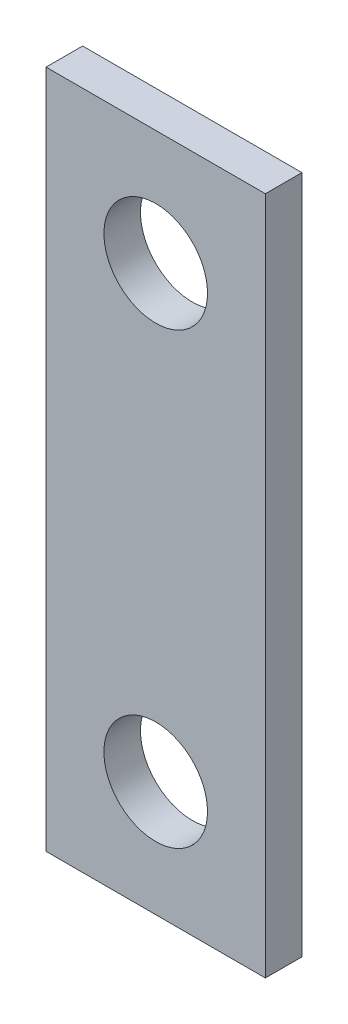
ISO-10303-21;
HEADER;
FILE_DESCRIPTION(('STEP AP214'),'2;1');
FILE_NAME('part.step','',(''),(''),'','','');
FILE_SCHEMA(('AUTOMOTIVE_DESIGN { 1 0 10303 214 1 1 1 1 }'));
ENDSEC;
DATA;
#1=APPLICATION_CONTEXT('core data for automotive mechanical design processes');
#2=APPLICATION_PROTOCOL_DEFINITION('international standard','automotive_design',2000,#1);
#3=PRODUCT_CONTEXT('',#1,'mechanical');
#4=PRODUCT('Part','Part','',(#3));
#5=PRODUCT_RELATED_PRODUCT_CATEGORY('part','',(#4));
#6=PRODUCT_DEFINITION_FORMATION('','',#4);
#7=PRODUCT_DEFINITION_CONTEXT('part definition',#1,'design');
#8=PRODUCT_DEFINITION('design','',#6,#7);
#9=PRODUCT_DEFINITION_SHAPE('','',#8);
#10=(LENGTH_UNIT() NAMED_UNIT(*) SI_UNIT(.MILLI.,.METRE.));
#11=(NAMED_UNIT(*) PLANE_ANGLE_UNIT() SI_UNIT($,.RADIAN.));
#12=(NAMED_UNIT(*) SI_UNIT($,.STERADIAN.) SOLID_ANGLE_UNIT());
#13=UNCERTAINTY_MEASURE_WITH_UNIT(LENGTH_MEASURE(1.E-05),#10,'distance_accuracy_value','');
#14=(GEOMETRIC_REPRESENTATION_CONTEXT(3) GLOBAL_UNCERTAINTY_ASSIGNED_CONTEXT((#13)) GLOBAL_UNIT_ASSIGNED_CONTEXT((#10,
#11,#12)) REPRESENTATION_CONTEXT('',''));
#15=CARTESIAN_POINT('',(0.,0.,0.));
#16=DIRECTION('',(0.,0.,1.));
#17=DIRECTION('',(1.,0.,0.));
#18=AXIS2_PLACEMENT_3D('',#15,#16,#17);
#19=CARTESIAN_POINT('',(7.47499999999997,9.99999999999999,3.175));
#20=DIRECTION('',(0.,1.,0.));
#21=DIRECTION('',(0.,0.,1.));
#22=AXIS2_PLACEMENT_3D('',#19,#20,#21);
#23=PLANE('',#22);
#24=DIRECTION('',(1.,0.,0.));
#25=VECTOR('',#24,1.);
#26=CARTESIAN_POINT('',(7.47499999999997,9.99999999999999,0.));
#27=LINE('',#26,#25);
#28=CARTESIAN_POINT('',(7.47499999999997,9.99999999999999,0.));
#29=VERTEX_POINT('',#28);
#30=CARTESIAN_POINT('',(26.525,9.99999999999999,0.));
#31=VERTEX_POINT('',#30);
#32=EDGE_CURVE('E99',#29,#31,#27,.T.);
#33=ORIENTED_EDGE('',*,*,#32,.F.);
#34=DIRECTION('',(0.,0.,-1.));
#35=VECTOR('',#34,1.);
#36=CARTESIAN_POINT('',(7.47499999999997,9.99999999999999,3.175));
#37=LINE('',#36,#35);
#38=CARTESIAN_POINT('',(7.47499999999997,9.99999999999999,3.175));
#39=VERTEX_POINT('',#38);
#40=EDGE_CURVE('E11',#39,#29,#37,.T.);
#41=ORIENTED_EDGE('',*,*,#40,.F.);
#42=DIRECTION('',(1.,0.,0.));
#43=VECTOR('',#42,1.);
#44=CARTESIAN_POINT('',(7.47499999999997,9.99999999999999,3.175));
#45=LINE('',#44,#43);
#46=CARTESIAN_POINT('',(26.525,9.99999999999999,3.175));
#47=VERTEX_POINT('',#46);
#48=EDGE_CURVE('E93',#39,#47,#45,.T.);
#49=ORIENTED_EDGE('',*,*,#48,.T.);
#50=DIRECTION('',(0.,0.,-1.));
#51=VECTOR('',#50,1.);
#52=CARTESIAN_POINT('',(26.525,9.99999999999999,3.175));
#53=LINE('',#52,#51);
#54=EDGE_CURVE('E36',#47,#31,#53,.T.);
#55=ORIENTED_EDGE('',*,*,#54,.T.);
#56=EDGE_LOOP('',(#33,#41,#49,#55));
#57=FACE_BOUND('',#56,.T.);
#58=ADVANCED_FACE('F33',(#57),#23,.T.);
#59=CARTESIAN_POINT('',(7.47499999999997,9.99999999999999,3.175));
#60=DIRECTION('',(1.,0.,0.));
#61=DIRECTION('',(0.,1.,0.));
#62=AXIS2_PLACEMENT_3D('',#59,#60,#61);
#63=PLANE('',#62);
#64=DIRECTION('',(0.,-1.,0.));
#65=VECTOR('',#64,1.);
#66=CARTESIAN_POINT('',(7.47499999999997,9.99999999999999,0.));
#67=LINE('',#66,#65);
#68=CARTESIAN_POINT('',(7.47499999999997,-49.0000000000002,0.));
#69=VERTEX_POINT('',#68);
#70=EDGE_CURVE('E66',#29,#69,#67,.T.);
#71=ORIENTED_EDGE('',*,*,#70,.T.);
#72=DIRECTION('',(0.,0.,-1.));
#73=VECTOR('',#72,1.);
#74=CARTESIAN_POINT('',(7.47499999999997,-49.0000000000002,3.175));
#75=LINE('',#74,#73);
#76=CARTESIAN_POINT('',(7.47499999999997,-49.0000000000002,3.175));
#77=VERTEX_POINT('',#76);
#78=EDGE_CURVE('E42',#77,#69,#75,.T.);
#79=ORIENTED_EDGE('',*,*,#78,.F.);
#80=DIRECTION('',(0.,-1.,0.));
#81=VECTOR('',#80,1.);
#82=CARTESIAN_POINT('',(7.47499999999997,9.99999999999999,3.175));
#83=LINE('',#82,#81);
#84=EDGE_CURVE('E83',#39,#77,#83,.T.);
#85=ORIENTED_EDGE('',*,*,#84,.F.);
#86=ORIENTED_EDGE('',*,*,#40,.T.);
#87=EDGE_LOOP('',(#71,#79,#85,#86));
#88=FACE_BOUND('',#87,.T.);
#89=ADVANCED_FACE('F110',(#88),#63,.F.);
#90=CARTESIAN_POINT('',(7.47499999999997,-49.0000000000002,3.175));
#91=DIRECTION('',(0.,1.,0.));
#92=DIRECTION('',(0.,0.,1.));
#93=AXIS2_PLACEMENT_3D('',#90,#91,#92);
#94=PLANE('',#93);
#95=DIRECTION('',(1.,0.,0.));
#96=VECTOR('',#95,1.);
#97=CARTESIAN_POINT('',(7.47499999999997,-49.0000000000002,0.));
#98=LINE('',#97,#96);
#99=CARTESIAN_POINT('',(26.525,-49.0000000000002,0.));
#100=VERTEX_POINT('',#99);
#101=EDGE_CURVE('E90',#69,#100,#98,.T.);
#102=ORIENTED_EDGE('',*,*,#101,.T.);
#103=DIRECTION('',(0.,0.,-1.));
#104=VECTOR('',#103,1.);
#105=CARTESIAN_POINT('',(26.525,-49.0000000000002,3.175));
#106=LINE('',#105,#104);
#107=CARTESIAN_POINT('',(26.525,-49.0000000000002,3.175));
#108=VERTEX_POINT('',#107);
#109=EDGE_CURVE('E87',#108,#100,#106,.T.);
#110=ORIENTED_EDGE('',*,*,#109,.F.);
#111=DIRECTION('',(1.,0.,0.));
#112=VECTOR('',#111,1.);
#113=CARTESIAN_POINT('',(7.47499999999997,-49.0000000000002,3.175));
#114=LINE('',#113,#112);
#115=EDGE_CURVE('E78',#77,#108,#114,.T.);
#116=ORIENTED_EDGE('',*,*,#115,.F.);
#117=ORIENTED_EDGE('',*,*,#78,.T.);
#118=EDGE_LOOP('',(#102,#110,#116,#117));
#119=FACE_BOUND('',#118,.T.);
#120=ADVANCED_FACE('F88',(#119),#94,.F.);
#121=CARTESIAN_POINT('',(26.525,9.99999999999999,3.175));
#122=DIRECTION('',(1.,0.,0.));
#123=DIRECTION('',(0.,1.,0.));
#124=AXIS2_PLACEMENT_3D('',#121,#122,#123);
#125=PLANE('',#124);
#126=DIRECTION('',(0.,-1.,0.));
#127=VECTOR('',#126,1.);
#128=CARTESIAN_POINT('',(26.525,9.99999999999999,0.));
#129=LINE('',#128,#127);
#130=EDGE_CURVE('E102',#31,#100,#129,.T.);
#131=ORIENTED_EDGE('',*,*,#130,.F.);
#132=ORIENTED_EDGE('',*,*,#54,.F.);
#133=DIRECTION('',(0.,-1.,0.));
#134=VECTOR('',#133,1.);
#135=CARTESIAN_POINT('',(26.525,9.99999999999999,3.175));
#136=LINE('',#135,#134);
#137=EDGE_CURVE('E82',#47,#108,#136,.T.);
#138=ORIENTED_EDGE('',*,*,#137,.T.);
#139=ORIENTED_EDGE('',*,*,#109,.T.);
#140=EDGE_LOOP('',(#131,#132,#138,#139));
#141=FACE_BOUND('',#140,.T.);
#142=ADVANCED_FACE('F92',(#141),#125,.T.);
#143=CARTESIAN_POINT('',(0.,0.,3.175));
#144=DIRECTION('',(0.,0.,-1.));
#145=DIRECTION('',(-1.,0.,0.));
#146=AXIS2_PLACEMENT_3D('',#143,#144,#145);
#147=PLANE('',#146);
#148=CARTESIAN_POINT('',(17.,0.,3.175));
#149=DIRECTION('',(0.,0.,1.));
#150=DIRECTION('',(1.,0.,0.));
#151=AXIS2_PLACEMENT_3D('',#148,#149,#150);
#152=CIRCLE('',#151,4.5);
#153=CARTESIAN_POINT('',(21.5,0.,3.175));
#154=VERTEX_POINT('',#153);
#155=EDGE_CURVE('E147',#154,#154,#152,.T.);
#156=ORIENTED_EDGE('',*,*,#155,.F.);
#157=EDGE_LOOP('',(#156));
#158=FACE_BOUND('',#157,.T.);
#159=CARTESIAN_POINT('',(17.,-39.0000000000001,3.175));
#160=DIRECTION('',(0.,0.,1.));
#161=DIRECTION('',(1.,0.,0.));
#162=AXIS2_PLACEMENT_3D('',#159,#160,#161);
#163=CIRCLE('',#162,4.5);
#164=CARTESIAN_POINT('',(21.5,-39.0000000000001,3.175));
#165=VERTEX_POINT('',#164);
#166=EDGE_CURVE('E149',#165,#165,#163,.T.);
#167=ORIENTED_EDGE('',*,*,#166,.F.);
#168=EDGE_LOOP('',(#167));
#169=FACE_BOUND('',#168,.T.);
#170=ORIENTED_EDGE('',*,*,#48,.F.);
#171=ORIENTED_EDGE('',*,*,#84,.T.);
#172=ORIENTED_EDGE('',*,*,#115,.T.);
#173=ORIENTED_EDGE('',*,*,#137,.F.);
#174=EDGE_LOOP('',(#170,#171,#172,#173));
#175=FACE_BOUND('',#174,.T.);
#176=ADVANCED_FACE('F81',(#158,#169,#175),#147,.F.);
#177=CARTESIAN_POINT('',(0.,0.,0.));
#178=DIRECTION('',(0.,0.,-1.));
#179=DIRECTION('',(-1.,0.,0.));
#180=AXIS2_PLACEMENT_3D('',#177,#178,#179);
#181=PLANE('',#180);
#182=CARTESIAN_POINT('',(17.,0.,0.));
#183=DIRECTION('',(0.,0.,1.));
#184=DIRECTION('',(1.,0.,0.));
#185=AXIS2_PLACEMENT_3D('',#182,#183,#184);
#186=CIRCLE('',#185,4.5);
#187=CARTESIAN_POINT('',(21.5,0.,0.));
#188=VERTEX_POINT('',#187);
#189=EDGE_CURVE('E145',#188,#188,#186,.T.);
#190=ORIENTED_EDGE('',*,*,#189,.T.);
#191=EDGE_LOOP('',(#190));
#192=FACE_BOUND('',#191,.T.);
#193=CARTESIAN_POINT('',(17.,-39.0000000000001,0.));
#194=DIRECTION('',(0.,0.,1.));
#195=DIRECTION('',(1.,0.,0.));
#196=AXIS2_PLACEMENT_3D('',#193,#194,#195);
#197=CIRCLE('',#196,4.5);
#198=CARTESIAN_POINT('',(21.5,-39.0000000000001,0.));
#199=VERTEX_POINT('',#198);
#200=EDGE_CURVE('E103',#199,#199,#197,.T.);
#201=ORIENTED_EDGE('',*,*,#200,.T.);
#202=EDGE_LOOP('',(#201));
#203=FACE_BOUND('',#202,.T.);
#204=ORIENTED_EDGE('',*,*,#32,.T.);
#205=ORIENTED_EDGE('',*,*,#130,.T.);
#206=ORIENTED_EDGE('',*,*,#101,.F.);
#207=ORIENTED_EDGE('',*,*,#70,.F.);
#208=EDGE_LOOP('',(#204,#205,#206,#207));
#209=FACE_BOUND('',#208,.T.);
#210=ADVANCED_FACE('F108',(#192,#203,#209),#181,.T.);
#211=CARTESIAN_POINT('',(17.,-39.0000000000001,3.175));
#212=DIRECTION('',(0.,0.,1.));
#213=DIRECTION('',(1.,0.,0.));
#214=AXIS2_PLACEMENT_3D('',#211,#212,#213);
#215=CYLINDRICAL_SURFACE('',#214,4.5);
#216=ORIENTED_EDGE('',*,*,#200,.F.);
#217=EDGE_LOOP('',(#216));
#218=FACE_BOUND('',#217,.T.);
#219=ORIENTED_EDGE('',*,*,#166,.T.);
#220=EDGE_LOOP('',(#219));
#221=FACE_BOUND('',#220,.T.);
#222=ADVANCED_FACE('F129',(#218,#221),#215,.F.);
#223=CARTESIAN_POINT('',(17.,0.,3.175));
#224=DIRECTION('',(0.,0.,1.));
#225=DIRECTION('',(1.,0.,0.));
#226=AXIS2_PLACEMENT_3D('',#223,#224,#225);
#227=CYLINDRICAL_SURFACE('',#226,4.5);
#228=ORIENTED_EDGE('',*,*,#189,.F.);
#229=EDGE_LOOP('',(#228));
#230=FACE_BOUND('',#229,.T.);
#231=ORIENTED_EDGE('',*,*,#155,.T.);
#232=EDGE_LOOP('',(#231));
#233=FACE_BOUND('',#232,.T.);
#234=ADVANCED_FACE('F136',(#230,#233),#227,.F.);
#235=CLOSED_SHELL('',(#58,#89,#120,#142,#176,#210,#222,#234));
#236=MANIFOLD_SOLID_BREP('B2',#235);
#237=ADVANCED_BREP_SHAPE_REPRESENTATION('',(#18,#236),#14);
#238=SHAPE_DEFINITION_REPRESENTATION(#9,#237);
ENDSEC;
END-ISO-10303-21;
